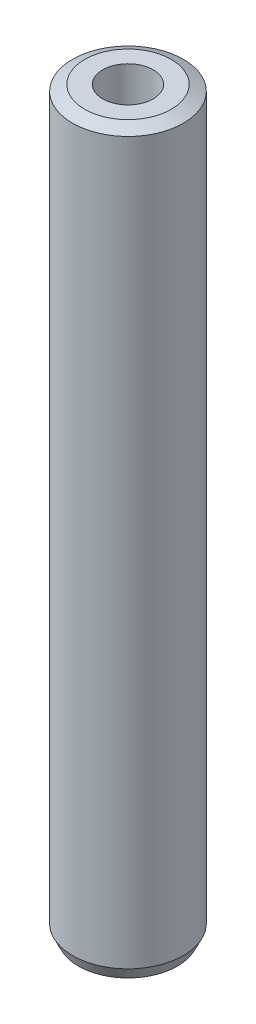
ISO-10303-21;
HEADER;
FILE_DESCRIPTION(('STEP AP214'),'2;1');
FILE_NAME('part.step','',(''),(''),'','','');
FILE_SCHEMA(('AUTOMOTIVE_DESIGN { 1 0 10303 214 1 1 1 1 }'));
ENDSEC;
DATA;
#1=APPLICATION_CONTEXT('core data for automotive mechanical design processes');
#2=APPLICATION_PROTOCOL_DEFINITION('international standard','automotive_design',2000,#1);
#3=PRODUCT_CONTEXT('',#1,'mechanical');
#4=PRODUCT('Part','Part','',(#3));
#5=PRODUCT_RELATED_PRODUCT_CATEGORY('part','',(#4));
#6=PRODUCT_DEFINITION_FORMATION('','',#4);
#7=PRODUCT_DEFINITION_CONTEXT('part definition',#1,'design');
#8=PRODUCT_DEFINITION('design','',#6,#7);
#9=PRODUCT_DEFINITION_SHAPE('','',#8);
#10=(LENGTH_UNIT() NAMED_UNIT(*) SI_UNIT(.MILLI.,.METRE.));
#11=(NAMED_UNIT(*) PLANE_ANGLE_UNIT() SI_UNIT($,.RADIAN.));
#12=(NAMED_UNIT(*) SI_UNIT($,.STERADIAN.) SOLID_ANGLE_UNIT());
#13=UNCERTAINTY_MEASURE_WITH_UNIT(LENGTH_MEASURE(1.E-05),#10,'distance_accuracy_value','');
#14=(GEOMETRIC_REPRESENTATION_CONTEXT(3) GLOBAL_UNCERTAINTY_ASSIGNED_CONTEXT((#13)) GLOBAL_UNIT_ASSIGNED_CONTEXT((#10,
#11,#12)) REPRESENTATION_CONTEXT('',''));
#15=CARTESIAN_POINT('',(0.,0.,0.));
#16=DIRECTION('',(0.,0.,1.));
#17=DIRECTION('',(1.,0.,0.));
#18=AXIS2_PLACEMENT_3D('',#15,#16,#17);
#19=CARTESIAN_POINT('',(0.,600.,0.));
#20=DIRECTION('',(0.,-1.,0.));
#21=DIRECTION('',(0.,0.,-1.));
#22=AXIS2_PLACEMENT_3D('',#19,#20,#21);
#23=CYLINDRICAL_SURFACE('',#22,45.);
#24=CARTESIAN_POINT('',(0.,595.14293499308,0.));
#25=DIRECTION('',(0.,1.,0.));
#26=DIRECTION('',(0.,0.,1.));
#27=AXIS2_PLACEMENT_3D('',#24,#25,#26);
#28=CIRCLE('',#27,45.);
#29=CARTESIAN_POINT('',(0.,595.14293499308,45.));
#30=VERTEX_POINT('',#29);
#31=EDGE_CURVE('E50',#30,#30,#28,.F.);
#32=ORIENTED_EDGE('',*,*,#31,.T.);
#33=EDGE_LOOP('',(#32));
#34=FACE_BOUND('',#33,.T.);
#35=CARTESIAN_POINT('',(0.,9.87331809413372,0.));
#36=DIRECTION('',(0.,1.,0.));
#37=DIRECTION('',(0.,0.,1.));
#38=AXIS2_PLACEMENT_3D('',#35,#36,#37);
#39=CIRCLE('',#38,45.);
#40=CARTESIAN_POINT('',(0.,9.87331809413372,45.));
#41=VERTEX_POINT('',#40);
#42=EDGE_CURVE('E51',#41,#41,#39,.T.);
#43=ORIENTED_EDGE('',*,*,#42,.T.);
#44=EDGE_LOOP('',(#43));
#45=FACE_BOUND('',#44,.T.);
#46=ADVANCED_FACE('F39',(#34,#45),#23,.T.);
#47=CARTESIAN_POINT('',(0.,600.,0.));
#48=DIRECTION('',(0.,1.,0.));
#49=DIRECTION('',(0.,0.,1.));
#50=AXIS2_PLACEMENT_3D('',#47,#48,#49);
#51=PLANE('',#50);
#52=CARTESIAN_POINT('',(0.,600.,0.));
#53=DIRECTION('',(0.,1.,0.));
#54=DIRECTION('',(0.,0.,1.));
#55=AXIS2_PLACEMENT_3D('',#52,#53,#54);
#56=CIRCLE('',#55,35.1266819058665);
#57=CARTESIAN_POINT('',(0.,600.,35.1266819058665));
#58=VERTEX_POINT('',#57);
#59=EDGE_CURVE('E54',#58,#58,#56,.T.);
#60=ORIENTED_EDGE('',*,*,#59,.T.);
#61=EDGE_LOOP('',(#60));
#62=FACE_BOUND('',#61,.T.);
#63=CARTESIAN_POINT('',(0.,600.,0.));
#64=DIRECTION('',(0.,1.,0.));
#65=DIRECTION('',(0.,0.,1.));
#66=AXIS2_PLACEMENT_3D('',#63,#64,#65);
#67=CIRCLE('',#66,20.4916970712775);
#68=CARTESIAN_POINT('',(0.,600.,20.4916970712775));
#69=VERTEX_POINT('',#68);
#70=EDGE_CURVE('E58',#69,#69,#67,.T.);
#71=ORIENTED_EDGE('',*,*,#70,.F.);
#72=EDGE_LOOP('',(#71));
#73=FACE_BOUND('',#72,.T.);
#74=ADVANCED_FACE('F69',(#62,#73),#51,.T.);
#75=CARTESIAN_POINT('',(0.,0.,0.));
#76=DIRECTION('',(0.,1.,0.));
#77=DIRECTION('',(0.,0.,1.));
#78=AXIS2_PLACEMENT_3D('',#75,#76,#77);
#79=PLANE('',#78);
#80=CARTESIAN_POINT('',(0.,0.,0.));
#81=DIRECTION('',(0.,1.,0.));
#82=DIRECTION('',(0.,0.,1.));
#83=AXIS2_PLACEMENT_3D('',#80,#81,#82);
#84=CIRCLE('',#83,40.1429349930801);
#85=CARTESIAN_POINT('',(0.,0.,40.1429349930801));
#86=VERTEX_POINT('',#85);
#87=EDGE_CURVE('E10',#86,#86,#84,.F.);
#88=ORIENTED_EDGE('',*,*,#87,.T.);
#89=EDGE_LOOP('',(#88));
#90=FACE_BOUND('',#89,.T.);
#91=CARTESIAN_POINT('',(0.,0.,0.));
#92=DIRECTION('',(0.,1.,0.));
#93=DIRECTION('',(0.,0.,1.));
#94=AXIS2_PLACEMENT_3D('',#91,#92,#93);
#95=CIRCLE('',#94,20.4916970712775);
#96=CARTESIAN_POINT('',(0.,0.,20.4916970712775));
#97=VERTEX_POINT('',#96);
#98=EDGE_CURVE('E63',#97,#97,#95,.T.);
#99=ORIENTED_EDGE('',*,*,#98,.T.);
#100=EDGE_LOOP('',(#99));
#101=FACE_BOUND('',#100,.T.);
#102=ADVANCED_FACE('F75',(#90,#101),#79,.F.);
#103=CARTESIAN_POINT('',(0.,600.,0.));
#104=DIRECTION('',(0.,-1.,0.));
#105=DIRECTION('',(0.,0.,-1.));
#106=AXIS2_PLACEMENT_3D('',#103,#104,#105);
#107=CYLINDRICAL_SURFACE('',#106,20.4916970712775);
#108=ORIENTED_EDGE('',*,*,#70,.T.);
#109=EDGE_LOOP('',(#108));
#110=FACE_BOUND('',#109,.T.);
#111=ORIENTED_EDGE('',*,*,#98,.F.);
#112=EDGE_LOOP('',(#111));
#113=FACE_BOUND('',#112,.T.);
#114=ADVANCED_FACE('F70',(#110,#113),#107,.F.);
#115=CARTESIAN_POINT('',(0.,600.,0.));
#116=DIRECTION('',(0.,-1.,0.));
#117=DIRECTION('',(0.,0.,-1.));
#118=AXIS2_PLACEMENT_3D('',#115,#116,#117);
#119=CONICAL_SURFACE('',#118,35.1266819058665,1.1136187142298);
#120=ORIENTED_EDGE('',*,*,#31,.F.);
#121=EDGE_LOOP('',(#120));
#122=FACE_BOUND('',#121,.T.);
#123=ORIENTED_EDGE('',*,*,#59,.F.);
#124=EDGE_LOOP('',(#123));
#125=FACE_BOUND('',#124,.T.);
#126=ADVANCED_FACE('F81',(#122,#125),#119,.T.);
#127=CARTESIAN_POINT('',(0.,9.87331809413372,0.));
#128=DIRECTION('',(0.,1.,0.));
#129=DIRECTION('',(0.,0.,1.));
#130=AXIS2_PLACEMENT_3D('',#127,#128,#129);
#131=CONICAL_SURFACE('',#130,45.,0.457177612565096);
#132=ORIENTED_EDGE('',*,*,#87,.F.);
#133=EDGE_LOOP('',(#132));
#134=FACE_BOUND('',#133,.T.);
#135=ORIENTED_EDGE('',*,*,#42,.F.);
#136=EDGE_LOOP('',(#135));
#137=FACE_BOUND('',#136,.T.);
#138=ADVANCED_FACE('F45',(#134,#137),#131,.T.);
#139=CLOSED_SHELL('',(#46,#74,#102,#114,#126,#138));
#140=MANIFOLD_SOLID_BREP('B2',#139);
#141=ADVANCED_BREP_SHAPE_REPRESENTATION('',(#18,#140),#14);
#142=SHAPE_DEFINITION_REPRESENTATION(#9,#141);
ENDSEC;
END-ISO-10303-21;
